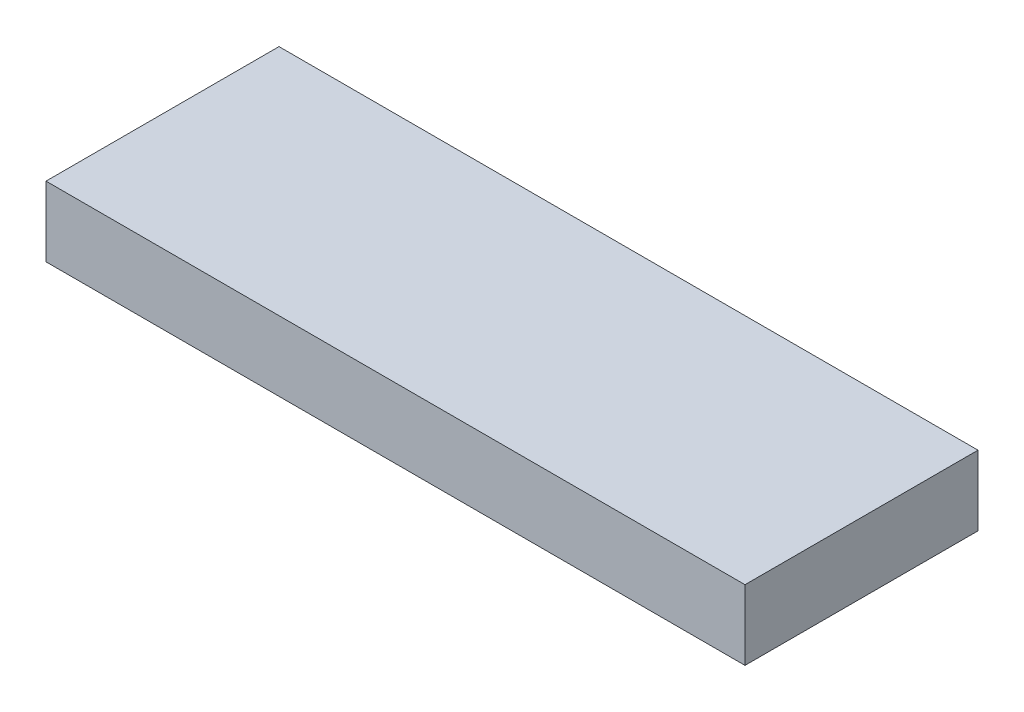
ISO-10303-21;
HEADER;
FILE_DESCRIPTION(('STEP AP214'),'2;1');
FILE_NAME('part.step','',(''),(''),'','','');
FILE_SCHEMA(('AUTOMOTIVE_DESIGN { 1 0 10303 214 1 1 1 1 }'));
ENDSEC;
DATA;
#1=APPLICATION_CONTEXT('core data for automotive mechanical design processes');
#2=APPLICATION_PROTOCOL_DEFINITION('international standard','automotive_design',2000,#1);
#3=PRODUCT_CONTEXT('',#1,'mechanical');
#4=PRODUCT('Part','Part','',(#3));
#5=PRODUCT_RELATED_PRODUCT_CATEGORY('part','',(#4));
#6=PRODUCT_DEFINITION_FORMATION('','',#4);
#7=PRODUCT_DEFINITION_CONTEXT('part definition',#1,'design');
#8=PRODUCT_DEFINITION('design','',#6,#7);
#9=PRODUCT_DEFINITION_SHAPE('','',#8);
#10=(LENGTH_UNIT() NAMED_UNIT(*) SI_UNIT(.MILLI.,.METRE.));
#11=(NAMED_UNIT(*) PLANE_ANGLE_UNIT() SI_UNIT($,.RADIAN.));
#12=(NAMED_UNIT(*) SI_UNIT($,.STERADIAN.) SOLID_ANGLE_UNIT());
#13=UNCERTAINTY_MEASURE_WITH_UNIT(LENGTH_MEASURE(1.E-05),#10,'distance_accuracy_value','');
#14=(GEOMETRIC_REPRESENTATION_CONTEXT(3) GLOBAL_UNCERTAINTY_ASSIGNED_CONTEXT((#13)) GLOBAL_UNIT_ASSIGNED_CONTEXT((#10,
#11,#12)) REPRESENTATION_CONTEXT('',''));
#15=CARTESIAN_POINT('',(0.,0.,0.));
#16=DIRECTION('',(0.,0.,1.));
#17=DIRECTION('',(1.,0.,0.));
#18=AXIS2_PLACEMENT_3D('',#15,#16,#17);
#19=CARTESIAN_POINT('',(-300.,-50.01,23.));
#20=DIRECTION('',(0.,0.,1.));
#21=DIRECTION('',(1.,0.,0.));
#22=AXIS2_PLACEMENT_3D('',#19,#20,#21);
#23=PLANE('',#22);
#24=DIRECTION('',(0.,1.,0.));
#25=VECTOR('',#24,1.);
#26=CARTESIAN_POINT('',(-300.,0.,23.));
#27=LINE('',#26,#25);
#28=CARTESIAN_POINT('',(-300.,-50.,23.));
#29=VERTEX_POINT('',#28);
#30=CARTESIAN_POINT('',(-300.,-47.,23.));
#31=VERTEX_POINT('',#30);
#32=EDGE_CURVE('E60',#29,#31,#27,.T.);
#33=ORIENTED_EDGE('',*,*,#32,.F.);
#34=DIRECTION('',(1.,0.,0.));
#35=VECTOR('',#34,1.);
#36=CARTESIAN_POINT('',(-300.,-50.,23.));
#37=LINE('',#36,#35);
#38=CARTESIAN_POINT('',(-270.,-50.,23.));
#39=VERTEX_POINT('',#38);
#40=EDGE_CURVE('E94',#29,#39,#37,.T.);
#41=ORIENTED_EDGE('',*,*,#40,.T.);
#42=DIRECTION('',(0.,1.,0.));
#43=VECTOR('',#42,1.);
#44=CARTESIAN_POINT('',(-270.,-50.01,23.));
#45=LINE('',#44,#43);
#46=CARTESIAN_POINT('',(-270.,-47.,23.));
#47=VERTEX_POINT('',#46);
#48=EDGE_CURVE('E44',#39,#47,#45,.T.);
#49=ORIENTED_EDGE('',*,*,#48,.T.);
#50=DIRECTION('',(-1.,0.,0.));
#51=VECTOR('',#50,1.);
#52=CARTESIAN_POINT('',(-300.,-47.,23.));
#53=LINE('',#52,#51);
#54=EDGE_CURVE('E104',#47,#31,#53,.T.);
#55=ORIENTED_EDGE('',*,*,#54,.T.);
#56=EDGE_LOOP('',(#33,#41,#49,#55));
#57=FACE_BOUND('',#56,.T.);
#58=ADVANCED_FACE('F35',(#57),#23,.T.);
#59=CARTESIAN_POINT('',(-300.,-50.01,13.));
#60=DIRECTION('',(0.,0.,-1.));
#61=DIRECTION('',(-1.,0.,0.));
#62=AXIS2_PLACEMENT_3D('',#59,#60,#61);
#63=PLANE('',#62);
#64=DIRECTION('',(0.,1.,0.));
#65=VECTOR('',#64,1.);
#66=CARTESIAN_POINT('',(-270.,-50.01,13.));
#67=LINE('',#66,#65);
#68=CARTESIAN_POINT('',(-270.,-50.,13.));
#69=VERTEX_POINT('',#68);
#70=CARTESIAN_POINT('',(-270.,-47.,13.));
#71=VERTEX_POINT('',#70);
#72=EDGE_CURVE('E11',#69,#71,#67,.T.);
#73=ORIENTED_EDGE('',*,*,#72,.F.);
#74=DIRECTION('',(-1.,0.,0.));
#75=VECTOR('',#74,1.);
#76=CARTESIAN_POINT('',(-300.,-50.,13.));
#77=LINE('',#76,#75);
#78=CARTESIAN_POINT('',(-300.,-50.,13.));
#79=VERTEX_POINT('',#78);
#80=EDGE_CURVE('E95',#69,#79,#77,.T.);
#81=ORIENTED_EDGE('',*,*,#80,.T.);
#82=DIRECTION('',(0.,-1.,0.));
#83=VECTOR('',#82,1.);
#84=CARTESIAN_POINT('',(-300.,0.,13.));
#85=LINE('',#84,#83);
#86=CARTESIAN_POINT('',(-300.,-47.,13.));
#87=VERTEX_POINT('',#86);
#88=EDGE_CURVE('E52',#87,#79,#85,.T.);
#89=ORIENTED_EDGE('',*,*,#88,.F.);
#90=DIRECTION('',(1.,0.,0.));
#91=VECTOR('',#90,1.);
#92=CARTESIAN_POINT('',(-300.,-47.,13.));
#93=LINE('',#92,#91);
#94=EDGE_CURVE('E39',#87,#71,#93,.T.);
#95=ORIENTED_EDGE('',*,*,#94,.T.);
#96=EDGE_LOOP('',(#73,#81,#89,#95));
#97=FACE_BOUND('',#96,.T.);
#98=ADVANCED_FACE('F105',(#97),#63,.T.);
#99=CARTESIAN_POINT('',(-270.,-50.01,13.));
#100=DIRECTION('',(1.,0.,0.));
#101=DIRECTION('',(0.,0.,-1.));
#102=AXIS2_PLACEMENT_3D('',#99,#100,#101);
#103=PLANE('',#102);
#104=ORIENTED_EDGE('',*,*,#48,.F.);
#105=DIRECTION('',(0.,0.,-1.));
#106=VECTOR('',#105,1.);
#107=CARTESIAN_POINT('',(-270.,-50.,60.));
#108=LINE('',#107,#106);
#109=EDGE_CURVE('E81',#39,#69,#108,.T.);
#110=ORIENTED_EDGE('',*,*,#109,.T.);
#111=ORIENTED_EDGE('',*,*,#72,.T.);
#112=DIRECTION('',(0.,0.,1.));
#113=VECTOR('',#112,1.);
#114=CARTESIAN_POINT('',(-270.,-47.,3.));
#115=LINE('',#114,#113);
#116=EDGE_CURVE('E83',#71,#47,#115,.T.);
#117=ORIENTED_EDGE('',*,*,#116,.T.);
#118=EDGE_LOOP('',(#104,#110,#111,#117));
#119=FACE_BOUND('',#118,.T.);
#120=ADVANCED_FACE('F80',(#119),#103,.T.);
#121=CARTESIAN_POINT('',(-300.,0.,0.));
#122=DIRECTION('',(-1.,0.,0.));
#123=DIRECTION('',(0.,0.,1.));
#124=AXIS2_PLACEMENT_3D('',#121,#122,#123);
#125=PLANE('',#124);
#126=DIRECTION('',(0.,0.,-1.));
#127=VECTOR('',#126,1.);
#128=CARTESIAN_POINT('',(-300.,-50.,60.));
#129=LINE('',#128,#127);
#130=EDGE_CURVE('E100',#29,#79,#129,.T.);
#131=ORIENTED_EDGE('',*,*,#130,.F.);
#132=ORIENTED_EDGE('',*,*,#32,.T.);
#133=DIRECTION('',(0.,0.,1.));
#134=VECTOR('',#133,1.);
#135=CARTESIAN_POINT('',(-300.,-47.,3.));
#136=LINE('',#135,#134);
#137=EDGE_CURVE('E87',#87,#31,#136,.T.);
#138=ORIENTED_EDGE('',*,*,#137,.F.);
#139=ORIENTED_EDGE('',*,*,#88,.T.);
#140=EDGE_LOOP('',(#131,#132,#138,#139));
#141=FACE_BOUND('',#140,.T.);
#142=ADVANCED_FACE('F109',(#141),#125,.T.);
#143=CARTESIAN_POINT('',(-300.,-50.,60.));
#144=DIRECTION('',(0.,1.,0.));
#145=DIRECTION('',(0.,0.,1.));
#146=AXIS2_PLACEMENT_3D('',#143,#144,#145);
#147=PLANE('',#146);
#148=ORIENTED_EDGE('',*,*,#40,.F.);
#149=ORIENTED_EDGE('',*,*,#130,.T.);
#150=ORIENTED_EDGE('',*,*,#80,.F.);
#151=ORIENTED_EDGE('',*,*,#109,.F.);
#152=EDGE_LOOP('',(#148,#149,#150,#151));
#153=FACE_BOUND('',#152,.T.);
#154=ADVANCED_FACE('F92',(#153),#147,.F.);
#155=CARTESIAN_POINT('',(-300.,-47.,3.));
#156=DIRECTION('',(0.,-1.,0.));
#157=DIRECTION('',(0.,0.,-1.));
#158=AXIS2_PLACEMENT_3D('',#155,#156,#157);
#159=PLANE('',#158);
#160=ORIENTED_EDGE('',*,*,#54,.F.);
#161=ORIENTED_EDGE('',*,*,#116,.F.);
#162=ORIENTED_EDGE('',*,*,#94,.F.);
#163=ORIENTED_EDGE('',*,*,#137,.T.);
#164=EDGE_LOOP('',(#160,#161,#162,#163));
#165=FACE_BOUND('',#164,.T.);
#166=ADVANCED_FACE('F37',(#165),#159,.F.);
#167=CLOSED_SHELL('',(#58,#98,#120,#142,#154,#166));
#168=MANIFOLD_SOLID_BREP('B2',#167);
#169=ADVANCED_BREP_SHAPE_REPRESENTATION('',(#18,#168),#14);
#170=SHAPE_DEFINITION_REPRESENTATION(#9,#169);
ENDSEC;
END-ISO-10303-21;
